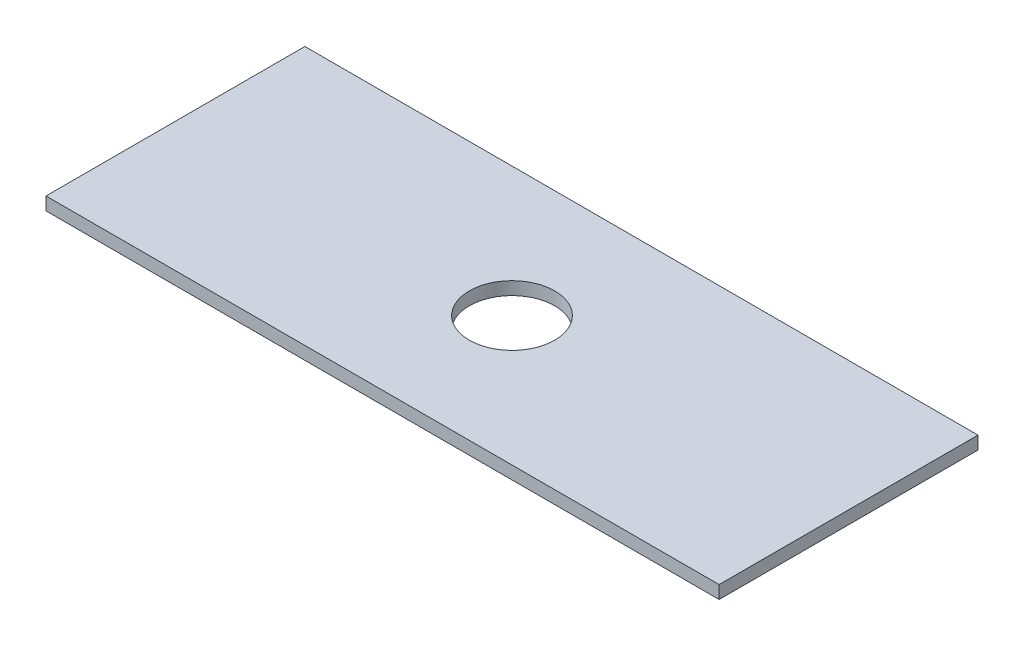
ISO-10303-21;
HEADER;
FILE_DESCRIPTION(('STEP AP214'),'2;1');
FILE_NAME('part.step','',(''),(''),'','','');
FILE_SCHEMA(('AUTOMOTIVE_DESIGN { 1 0 10303 214 1 1 1 1 }'));
ENDSEC;
DATA;
#1=APPLICATION_CONTEXT('core data for automotive mechanical design processes');
#2=APPLICATION_PROTOCOL_DEFINITION('international standard','automotive_design',2000,#1);
#3=PRODUCT_CONTEXT('',#1,'mechanical');
#4=PRODUCT('Part','Part','',(#3));
#5=PRODUCT_RELATED_PRODUCT_CATEGORY('part','',(#4));
#6=PRODUCT_DEFINITION_FORMATION('','',#4);
#7=PRODUCT_DEFINITION_CONTEXT('part definition',#1,'design');
#8=PRODUCT_DEFINITION('design','',#6,#7);
#9=PRODUCT_DEFINITION_SHAPE('','',#8);
#10=(LENGTH_UNIT() NAMED_UNIT(*) SI_UNIT(.MILLI.,.METRE.));
#11=(NAMED_UNIT(*) PLANE_ANGLE_UNIT() SI_UNIT($,.RADIAN.));
#12=(NAMED_UNIT(*) SI_UNIT($,.STERADIAN.) SOLID_ANGLE_UNIT());
#13=UNCERTAINTY_MEASURE_WITH_UNIT(LENGTH_MEASURE(1.E-05),#10,'distance_accuracy_value','');
#14=(GEOMETRIC_REPRESENTATION_CONTEXT(3) GLOBAL_UNCERTAINTY_ASSIGNED_CONTEXT((#13)) GLOBAL_UNIT_ASSIGNED_CONTEXT((#10,
#11,#12)) REPRESENTATION_CONTEXT('',''));
#15=CARTESIAN_POINT('',(0.,0.,0.));
#16=DIRECTION('',(0.,0.,1.));
#17=DIRECTION('',(1.,0.,0.));
#18=AXIS2_PLACEMENT_3D('',#15,#16,#17);
#19=CARTESIAN_POINT('',(0.,2.5,0.));
#20=DIRECTION('',(0.,-1.,0.));
#21=DIRECTION('',(0.,0.,-1.));
#22=AXIS2_PLACEMENT_3D('',#19,#20,#21);
#23=PLANE('',#22);
#24=DIRECTION('',(0.,0.,1.));
#25=VECTOR('',#24,1.);
#26=CARTESIAN_POINT('',(0.,2.5,0.));
#27=LINE('',#26,#25);
#28=CARTESIAN_POINT('',(0.,2.5,-50.));
#29=VERTEX_POINT('',#28);
#30=CARTESIAN_POINT('',(0.,2.5,0.));
#31=VERTEX_POINT('',#30);
#32=EDGE_CURVE('E92',#29,#31,#27,.T.);
#33=ORIENTED_EDGE('',*,*,#32,.T.);
#34=DIRECTION('',(1.,0.,0.));
#35=VECTOR('',#34,1.);
#36=CARTESIAN_POINT('',(0.,2.5,0.));
#37=LINE('',#36,#35);
#38=CARTESIAN_POINT('',(130.,2.5,0.));
#39=VERTEX_POINT('',#38);
#40=EDGE_CURVE('E87',#31,#39,#37,.T.);
#41=ORIENTED_EDGE('',*,*,#40,.T.);
#42=DIRECTION('',(0.,0.,-1.));
#43=VECTOR('',#42,1.);
#44=CARTESIAN_POINT('',(130.,2.5,0.));
#45=LINE('',#44,#43);
#46=CARTESIAN_POINT('',(130.,2.5,-50.));
#47=VERTEX_POINT('',#46);
#48=EDGE_CURVE('E90',#39,#47,#45,.T.);
#49=ORIENTED_EDGE('',*,*,#48,.T.);
#50=DIRECTION('',(-1.,0.,0.));
#51=VECTOR('',#50,1.);
#52=CARTESIAN_POINT('',(0.,2.5,-50.));
#53=LINE('',#52,#51);
#54=EDGE_CURVE('E57',#47,#29,#53,.T.);
#55=ORIENTED_EDGE('',*,*,#54,.T.);
#56=EDGE_LOOP('',(#33,#41,#49,#55));
#57=FACE_BOUND('',#56,.T.);
#58=CARTESIAN_POINT('',(65.,2.5,-25.));
#59=DIRECTION('',(0.,1.,0.));
#60=DIRECTION('',(0.,0.,1.));
#61=AXIS2_PLACEMENT_3D('',#58,#59,#60);
#62=CIRCLE('',#61,8.25000000000001);
#63=CARTESIAN_POINT('',(65.,2.5,-16.75));
#64=VERTEX_POINT('',#63);
#65=EDGE_CURVE('E112',#64,#64,#62,.T.);
#66=ORIENTED_EDGE('',*,*,#65,.F.);
#67=EDGE_LOOP('',(#66));
#68=FACE_BOUND('',#67,.T.);
#69=ADVANCED_FACE('F39',(#57,#68),#23,.F.);
#70=CARTESIAN_POINT('',(0.,0.,0.));
#71=DIRECTION('',(0.,-1.,0.));
#72=DIRECTION('',(0.,0.,-1.));
#73=AXIS2_PLACEMENT_3D('',#70,#71,#72);
#74=PLANE('',#73);
#75=DIRECTION('',(0.,0.,1.));
#76=VECTOR('',#75,1.);
#77=CARTESIAN_POINT('',(0.,0.,0.));
#78=LINE('',#77,#76);
#79=CARTESIAN_POINT('',(0.,0.,-50.));
#80=VERTEX_POINT('',#79);
#81=CARTESIAN_POINT('',(0.,0.,0.));
#82=VERTEX_POINT('',#81);
#83=EDGE_CURVE('E108',#80,#82,#78,.T.);
#84=ORIENTED_EDGE('',*,*,#83,.F.);
#85=DIRECTION('',(-1.,0.,0.));
#86=VECTOR('',#85,1.);
#87=CARTESIAN_POINT('',(0.,0.,-50.));
#88=LINE('',#87,#86);
#89=CARTESIAN_POINT('',(130.,0.,-50.));
#90=VERTEX_POINT('',#89);
#91=EDGE_CURVE('E80',#90,#80,#88,.T.);
#92=ORIENTED_EDGE('',*,*,#91,.F.);
#93=DIRECTION('',(0.,0.,-1.));
#94=VECTOR('',#93,1.);
#95=CARTESIAN_POINT('',(130.,0.,0.));
#96=LINE('',#95,#94);
#97=CARTESIAN_POINT('',(130.,0.,0.));
#98=VERTEX_POINT('',#97);
#99=EDGE_CURVE('E74',#98,#90,#96,.T.);
#100=ORIENTED_EDGE('',*,*,#99,.F.);
#101=DIRECTION('',(1.,0.,0.));
#102=VECTOR('',#101,1.);
#103=CARTESIAN_POINT('',(0.,0.,0.));
#104=LINE('',#103,#102);
#105=EDGE_CURVE('E97',#82,#98,#104,.T.);
#106=ORIENTED_EDGE('',*,*,#105,.F.);
#107=EDGE_LOOP('',(#84,#92,#100,#106));
#108=FACE_BOUND('',#107,.T.);
#109=CARTESIAN_POINT('',(65.,0.,-25.));
#110=DIRECTION('',(0.,1.,0.));
#111=DIRECTION('',(0.,0.,1.));
#112=AXIS2_PLACEMENT_3D('',#109,#110,#111);
#113=CIRCLE('',#112,8.25000000000001);
#114=CARTESIAN_POINT('',(65.,0.,-16.75));
#115=VERTEX_POINT('',#114);
#116=EDGE_CURVE('E130',#115,#115,#113,.T.);
#117=ORIENTED_EDGE('',*,*,#116,.T.);
#118=EDGE_LOOP('',(#117));
#119=FACE_BOUND('',#118,.T.);
#120=ADVANCED_FACE('F125',(#108,#119),#74,.T.);
#121=CARTESIAN_POINT('',(0.,2.5,0.));
#122=DIRECTION('',(1.,0.,0.));
#123=DIRECTION('',(0.,0.,-1.));
#124=AXIS2_PLACEMENT_3D('',#121,#122,#123);
#125=PLANE('',#124);
#126=ORIENTED_EDGE('',*,*,#83,.T.);
#127=DIRECTION('',(0.,-1.,0.));
#128=VECTOR('',#127,1.);
#129=CARTESIAN_POINT('',(0.,2.5,0.));
#130=LINE('',#129,#128);
#131=EDGE_CURVE('E11',#31,#82,#130,.T.);
#132=ORIENTED_EDGE('',*,*,#131,.F.);
#133=ORIENTED_EDGE('',*,*,#32,.F.);
#134=DIRECTION('',(0.,-1.,0.));
#135=VECTOR('',#134,1.);
#136=CARTESIAN_POINT('',(0.,2.5,-50.));
#137=LINE('',#136,#135);
#138=EDGE_CURVE('E104',#29,#80,#137,.T.);
#139=ORIENTED_EDGE('',*,*,#138,.T.);
#140=EDGE_LOOP('',(#126,#132,#133,#139));
#141=FACE_BOUND('',#140,.T.);
#142=ADVANCED_FACE('F41',(#141),#125,.F.);
#143=CARTESIAN_POINT('',(0.,2.5,0.));
#144=DIRECTION('',(0.,0.,-1.));
#145=DIRECTION('',(-1.,0.,0.));
#146=AXIS2_PLACEMENT_3D('',#143,#144,#145);
#147=PLANE('',#146);
#148=ORIENTED_EDGE('',*,*,#105,.T.);
#149=DIRECTION('',(0.,-1.,0.));
#150=VECTOR('',#149,1.);
#151=CARTESIAN_POINT('',(130.,2.5,0.));
#152=LINE('',#151,#150);
#153=EDGE_CURVE('E49',#39,#98,#152,.T.);
#154=ORIENTED_EDGE('',*,*,#153,.F.);
#155=ORIENTED_EDGE('',*,*,#40,.F.);
#156=ORIENTED_EDGE('',*,*,#131,.T.);
#157=EDGE_LOOP('',(#148,#154,#155,#156));
#158=FACE_BOUND('',#157,.T.);
#159=ADVANCED_FACE('F96',(#158),#147,.F.);
#160=CARTESIAN_POINT('',(130.,2.5,0.));
#161=DIRECTION('',(-1.,0.,0.));
#162=DIRECTION('',(0.,0.,1.));
#163=AXIS2_PLACEMENT_3D('',#160,#161,#162);
#164=PLANE('',#163);
#165=ORIENTED_EDGE('',*,*,#99,.T.);
#166=DIRECTION('',(0.,-1.,0.));
#167=VECTOR('',#166,1.);
#168=CARTESIAN_POINT('',(130.,2.5,-50.));
#169=LINE('',#168,#167);
#170=EDGE_CURVE('E99',#47,#90,#169,.T.);
#171=ORIENTED_EDGE('',*,*,#170,.F.);
#172=ORIENTED_EDGE('',*,*,#48,.F.);
#173=ORIENTED_EDGE('',*,*,#153,.T.);
#174=EDGE_LOOP('',(#165,#171,#172,#173));
#175=FACE_BOUND('',#174,.T.);
#176=ADVANCED_FACE('F100',(#175),#164,.F.);
#177=CARTESIAN_POINT('',(0.,2.5,-50.));
#178=DIRECTION('',(0.,0.,1.));
#179=DIRECTION('',(1.,0.,0.));
#180=AXIS2_PLACEMENT_3D('',#177,#178,#179);
#181=PLANE('',#180);
#182=ORIENTED_EDGE('',*,*,#91,.T.);
#183=ORIENTED_EDGE('',*,*,#138,.F.);
#184=ORIENTED_EDGE('',*,*,#54,.F.);
#185=ORIENTED_EDGE('',*,*,#170,.T.);
#186=EDGE_LOOP('',(#182,#183,#184,#185));
#187=FACE_BOUND('',#186,.T.);
#188=ADVANCED_FACE('F122',(#187),#181,.F.);
#189=CARTESIAN_POINT('',(65.,2.5,-25.));
#190=DIRECTION('',(0.,-1.,0.));
#191=DIRECTION('',(0.,0.,-1.));
#192=AXIS2_PLACEMENT_3D('',#189,#190,#191);
#193=CYLINDRICAL_SURFACE('',#192,8.25000000000001);
#194=ORIENTED_EDGE('',*,*,#65,.T.);
#195=EDGE_LOOP('',(#194));
#196=FACE_BOUND('',#195,.T.);
#197=ORIENTED_EDGE('',*,*,#116,.F.);
#198=EDGE_LOOP('',(#197));
#199=FACE_BOUND('',#198,.T.);
#200=ADVANCED_FACE('F138',(#196,#199),#193,.F.);
#201=CLOSED_SHELL('',(#69,#120,#142,#159,#176,#188,#200));
#202=MANIFOLD_SOLID_BREP('B2',#201);
#203=ADVANCED_BREP_SHAPE_REPRESENTATION('',(#18,#202),#14);
#204=SHAPE_DEFINITION_REPRESENTATION(#9,#203);
ENDSEC;
END-ISO-10303-21;
